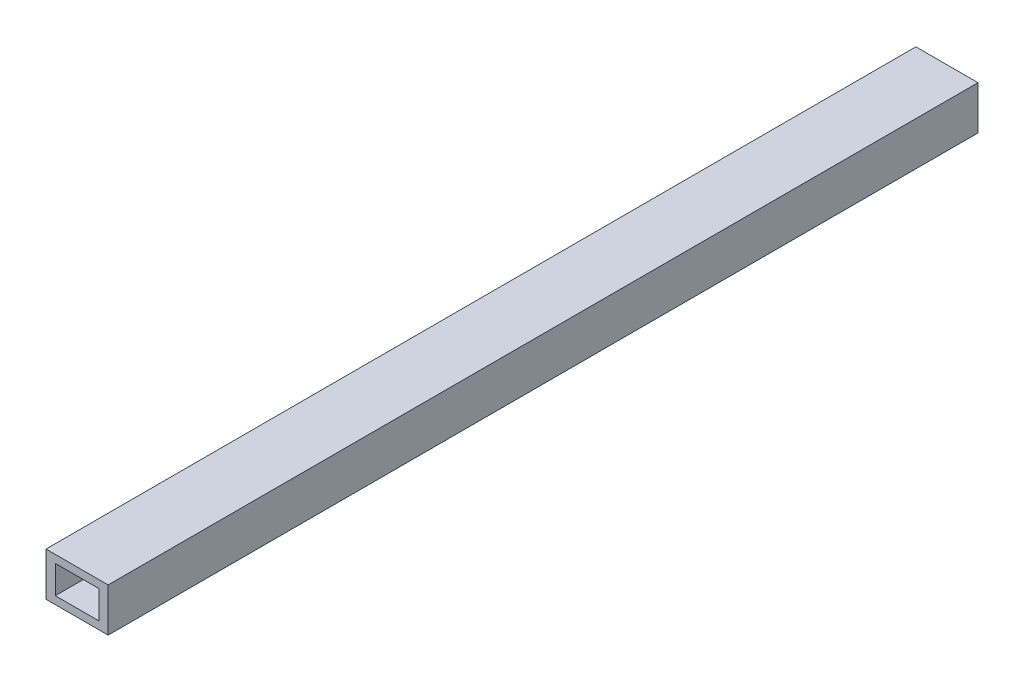
ISO-10303-21;
HEADER;
FILE_DESCRIPTION(('STEP AP214'),'2;1');
FILE_NAME('part.step','',(''),(''),'','','');
FILE_SCHEMA(('AUTOMOTIVE_DESIGN { 1 0 10303 214 1 1 1 1 }'));
ENDSEC;
DATA;
#1=APPLICATION_CONTEXT('core data for automotive mechanical design processes');
#2=APPLICATION_PROTOCOL_DEFINITION('international standard','automotive_design',2000,#1);
#3=PRODUCT_CONTEXT('',#1,'mechanical');
#4=PRODUCT('Part','Part','',(#3));
#5=PRODUCT_RELATED_PRODUCT_CATEGORY('part','',(#4));
#6=PRODUCT_DEFINITION_FORMATION('','',#4);
#7=PRODUCT_DEFINITION_CONTEXT('part definition',#1,'design');
#8=PRODUCT_DEFINITION('design','',#6,#7);
#9=PRODUCT_DEFINITION_SHAPE('','',#8);
#10=(LENGTH_UNIT() NAMED_UNIT(*) SI_UNIT(.MILLI.,.METRE.));
#11=(NAMED_UNIT(*) PLANE_ANGLE_UNIT() SI_UNIT($,.RADIAN.));
#12=(NAMED_UNIT(*) SI_UNIT($,.STERADIAN.) SOLID_ANGLE_UNIT());
#13=UNCERTAINTY_MEASURE_WITH_UNIT(LENGTH_MEASURE(1.E-05),#10,'distance_accuracy_value','');
#14=(GEOMETRIC_REPRESENTATION_CONTEXT(3) GLOBAL_UNCERTAINTY_ASSIGNED_CONTEXT((#13)) GLOBAL_UNIT_ASSIGNED_CONTEXT((#10,
#11,#12)) REPRESENTATION_CONTEXT('',''));
#15=CARTESIAN_POINT('',(0.,0.,0.));
#16=DIRECTION('',(0.,0.,1.));
#17=DIRECTION('',(1.,0.,0.));
#18=AXIS2_PLACEMENT_3D('',#15,#16,#17);
#19=CARTESIAN_POINT('',(-5.,-3.50241545893719,-140.));
#20=DIRECTION('',(-1.,0.,0.));
#21=DIRECTION('',(0.,0.,1.));
#22=AXIS2_PLACEMENT_3D('',#19,#20,#21);
#23=PLANE('',#22);
#24=DIRECTION('',(0.,-1.,0.));
#25=VECTOR('',#24,1.);
#26=CARTESIAN_POINT('',(-5.,-3.50241545893719,0.));
#27=LINE('',#26,#25);
#28=CARTESIAN_POINT('',(-5.,3.50241545893719,0.));
#29=VERTEX_POINT('',#28);
#30=CARTESIAN_POINT('',(-5.,-3.50241545893719,0.));
#31=VERTEX_POINT('',#30);
#32=EDGE_CURVE('E148',#29,#31,#27,.T.);
#33=ORIENTED_EDGE('',*,*,#32,.F.);
#34=DIRECTION('',(0.,0.,1.));
#35=VECTOR('',#34,1.);
#36=CARTESIAN_POINT('',(-5.,3.50241545893719,-140.));
#37=LINE('',#36,#35);
#38=CARTESIAN_POINT('',(-5.,3.50241545893719,-140.));
#39=VERTEX_POINT('',#38);
#40=EDGE_CURVE('E11',#39,#29,#37,.T.);
#41=ORIENTED_EDGE('',*,*,#40,.F.);
#42=DIRECTION('',(0.,-1.,0.));
#43=VECTOR('',#42,1.);
#44=CARTESIAN_POINT('',(-5.,-3.50241545893719,-140.));
#45=LINE('',#44,#43);
#46=CARTESIAN_POINT('',(-5.,-3.50241545893719,-140.));
#47=VERTEX_POINT('',#46);
#48=EDGE_CURVE('E154',#39,#47,#45,.T.);
#49=ORIENTED_EDGE('',*,*,#48,.T.);
#50=DIRECTION('',(0.,0.,1.));
#51=VECTOR('',#50,1.);
#52=CARTESIAN_POINT('',(-5.,-3.50241545893719,-140.));
#53=LINE('',#52,#51);
#54=EDGE_CURVE('E42',#47,#31,#53,.T.);
#55=ORIENTED_EDGE('',*,*,#54,.T.);
#56=EDGE_LOOP('',(#33,#41,#49,#55));
#57=FACE_BOUND('',#56,.T.);
#58=ADVANCED_FACE('F39',(#57),#23,.T.);
#59=CARTESIAN_POINT('',(5.,3.50241545893719,-140.));
#60=DIRECTION('',(0.,1.,0.));
#61=DIRECTION('',(0.,0.,1.));
#62=AXIS2_PLACEMENT_3D('',#59,#60,#61);
#63=PLANE('',#62);
#64=DIRECTION('',(-1.,0.,0.));
#65=VECTOR('',#64,1.);
#66=CARTESIAN_POINT('',(5.,3.50241545893719,0.));
#67=LINE('',#66,#65);
#68=CARTESIAN_POINT('',(5.,3.50241545893719,0.));
#69=VERTEX_POINT('',#68);
#70=EDGE_CURVE('E159',#69,#29,#67,.T.);
#71=ORIENTED_EDGE('',*,*,#70,.F.);
#72=DIRECTION('',(0.,0.,1.));
#73=VECTOR('',#72,1.);
#74=CARTESIAN_POINT('',(5.,3.50241545893719,-140.));
#75=LINE('',#74,#73);
#76=CARTESIAN_POINT('',(5.,3.50241545893719,-140.));
#77=VERTEX_POINT('',#76);
#78=EDGE_CURVE('E48',#77,#69,#75,.T.);
#79=ORIENTED_EDGE('',*,*,#78,.F.);
#80=DIRECTION('',(-1.,0.,0.));
#81=VECTOR('',#80,1.);
#82=CARTESIAN_POINT('',(5.,3.50241545893719,-140.));
#83=LINE('',#82,#81);
#84=EDGE_CURVE('E167',#77,#39,#83,.T.);
#85=ORIENTED_EDGE('',*,*,#84,.T.);
#86=ORIENTED_EDGE('',*,*,#40,.T.);
#87=EDGE_LOOP('',(#71,#79,#85,#86));
#88=FACE_BOUND('',#87,.T.);
#89=ADVANCED_FACE('F201',(#88),#63,.T.);
#90=CARTESIAN_POINT('',(5.,-3.50241545893719,-140.));
#91=DIRECTION('',(1.,0.,0.));
#92=DIRECTION('',(0.,0.,-1.));
#93=AXIS2_PLACEMENT_3D('',#90,#91,#92);
#94=PLANE('',#93);
#95=DIRECTION('',(0.,1.,0.));
#96=VECTOR('',#95,1.);
#97=CARTESIAN_POINT('',(5.,-3.50241545893719,0.));
#98=LINE('',#97,#96);
#99=CARTESIAN_POINT('',(5.,-3.50241545893719,0.));
#100=VERTEX_POINT('',#99);
#101=EDGE_CURVE('E178',#100,#69,#98,.T.);
#102=ORIENTED_EDGE('',*,*,#101,.F.);
#103=DIRECTION('',(0.,0.,1.));
#104=VECTOR('',#103,1.);
#105=CARTESIAN_POINT('',(5.,-3.50241545893719,-140.));
#106=LINE('',#105,#104);
#107=CARTESIAN_POINT('',(5.,-3.50241545893719,-140.));
#108=VERTEX_POINT('',#107);
#109=EDGE_CURVE('E186',#108,#100,#106,.T.);
#110=ORIENTED_EDGE('',*,*,#109,.F.);
#111=DIRECTION('',(0.,1.,0.));
#112=VECTOR('',#111,1.);
#113=CARTESIAN_POINT('',(5.,-3.50241545893719,-140.));
#114=LINE('',#113,#112);
#115=EDGE_CURVE('E163',#108,#77,#114,.T.);
#116=ORIENTED_EDGE('',*,*,#115,.T.);
#117=ORIENTED_EDGE('',*,*,#78,.T.);
#118=EDGE_LOOP('',(#102,#110,#116,#117));
#119=FACE_BOUND('',#118,.T.);
#120=ADVANCED_FACE('F205',(#119),#94,.T.);
#121=CARTESIAN_POINT('',(5.,-3.50241545893719,-140.));
#122=DIRECTION('',(0.,-1.,0.));
#123=DIRECTION('',(0.,0.,-1.));
#124=AXIS2_PLACEMENT_3D('',#121,#122,#123);
#125=PLANE('',#124);
#126=DIRECTION('',(1.,0.,0.));
#127=VECTOR('',#126,1.);
#128=CARTESIAN_POINT('',(5.,-3.50241545893719,0.));
#129=LINE('',#128,#127);
#130=EDGE_CURVE('E174',#31,#100,#129,.T.);
#131=ORIENTED_EDGE('',*,*,#130,.F.);
#132=ORIENTED_EDGE('',*,*,#54,.F.);
#133=DIRECTION('',(1.,0.,0.));
#134=VECTOR('',#133,1.);
#135=CARTESIAN_POINT('',(5.,-3.50241545893719,-140.));
#136=LINE('',#135,#134);
#137=EDGE_CURVE('E158',#47,#108,#136,.T.);
#138=ORIENTED_EDGE('',*,*,#137,.T.);
#139=ORIENTED_EDGE('',*,*,#109,.T.);
#140=EDGE_LOOP('',(#131,#132,#138,#139));
#141=FACE_BOUND('',#140,.T.);
#142=ADVANCED_FACE('F196',(#141),#125,.T.);
#143=CARTESIAN_POINT('',(0.,0.,-140.));
#144=DIRECTION('',(0.,0.,1.));
#145=DIRECTION('',(1.,0.,0.));
#146=AXIS2_PLACEMENT_3D('',#143,#144,#145);
#147=PLANE('',#146);
#148=DIRECTION('',(-1.,0.,0.));
#149=VECTOR('',#148,1.);
#150=CARTESIAN_POINT('',(3.5,2.2524154589372,-140.));
#151=LINE('',#150,#149);
#152=CARTESIAN_POINT('',(3.5,2.2524154589372,-140.));
#153=VERTEX_POINT('',#152);
#154=CARTESIAN_POINT('',(-3.5,2.25241545893719,-140.));
#155=VERTEX_POINT('',#154);
#156=EDGE_CURVE('E114',#153,#155,#151,.T.);
#157=ORIENTED_EDGE('',*,*,#156,.T.);
#158=DIRECTION('',(0.,-1.,0.));
#159=VECTOR('',#158,1.);
#160=CARTESIAN_POINT('',(-3.5,-2.2524154589372,-140.));
#161=LINE('',#160,#159);
#162=CARTESIAN_POINT('',(-3.5,-2.2524154589372,-140.));
#163=VERTEX_POINT('',#162);
#164=EDGE_CURVE('E107',#155,#163,#161,.T.);
#165=ORIENTED_EDGE('',*,*,#164,.T.);
#166=DIRECTION('',(1.,0.,0.));
#167=VECTOR('',#166,1.);
#168=CARTESIAN_POINT('',(3.5,-2.2524154589372,-140.));
#169=LINE('',#168,#167);
#170=CARTESIAN_POINT('',(3.5,-2.2524154589372,-140.));
#171=VERTEX_POINT('',#170);
#172=EDGE_CURVE('E117',#163,#171,#169,.T.);
#173=ORIENTED_EDGE('',*,*,#172,.T.);
#174=DIRECTION('',(0.,1.,0.));
#175=VECTOR('',#174,1.);
#176=CARTESIAN_POINT('',(3.5,-2.2524154589372,-140.));
#177=LINE('',#176,#175);
#178=EDGE_CURVE('E56',#171,#153,#177,.T.);
#179=ORIENTED_EDGE('',*,*,#178,.T.);
#180=EDGE_LOOP('',(#157,#165,#173,#179));
#181=FACE_BOUND('',#180,.T.);
#182=ORIENTED_EDGE('',*,*,#48,.F.);
#183=ORIENTED_EDGE('',*,*,#84,.F.);
#184=ORIENTED_EDGE('',*,*,#115,.F.);
#185=ORIENTED_EDGE('',*,*,#137,.F.);
#186=EDGE_LOOP('',(#182,#183,#184,#185));
#187=FACE_BOUND('',#186,.T.);
#188=ADVANCED_FACE('F122',(#181,#187),#147,.F.);
#189=CARTESIAN_POINT('',(0.,0.,0.));
#190=DIRECTION('',(0.,0.,1.));
#191=DIRECTION('',(1.,0.,0.));
#192=AXIS2_PLACEMENT_3D('',#189,#190,#191);
#193=PLANE('',#192);
#194=DIRECTION('',(0.,-1.,0.));
#195=VECTOR('',#194,1.);
#196=CARTESIAN_POINT('',(-3.5,-2.2524154589372,0.));
#197=LINE('',#196,#195);
#198=CARTESIAN_POINT('',(-3.5,2.25241545893719,0.));
#199=VERTEX_POINT('',#198);
#200=CARTESIAN_POINT('',(-3.5,-2.2524154589372,0.));
#201=VERTEX_POINT('',#200);
#202=EDGE_CURVE('E64',#199,#201,#197,.T.);
#203=ORIENTED_EDGE('',*,*,#202,.F.);
#204=DIRECTION('',(-1.,0.,0.));
#205=VECTOR('',#204,1.);
#206=CARTESIAN_POINT('',(3.5,2.2524154589372,0.));
#207=LINE('',#206,#205);
#208=CARTESIAN_POINT('',(3.5,2.2524154589372,0.));
#209=VERTEX_POINT('',#208);
#210=EDGE_CURVE('E126',#209,#199,#207,.T.);
#211=ORIENTED_EDGE('',*,*,#210,.F.);
#212=DIRECTION('',(0.,1.,0.));
#213=VECTOR('',#212,1.);
#214=CARTESIAN_POINT('',(3.5,-2.2524154589372,0.));
#215=LINE('',#214,#213);
#216=CARTESIAN_POINT('',(3.5,-2.2524154589372,0.));
#217=VERTEX_POINT('',#216);
#218=EDGE_CURVE('E130',#217,#209,#215,.T.);
#219=ORIENTED_EDGE('',*,*,#218,.F.);
#220=DIRECTION('',(1.,0.,0.));
#221=VECTOR('',#220,1.);
#222=CARTESIAN_POINT('',(3.5,-2.2524154589372,0.));
#223=LINE('',#222,#221);
#224=EDGE_CURVE('E139',#201,#217,#223,.T.);
#225=ORIENTED_EDGE('',*,*,#224,.F.);
#226=EDGE_LOOP('',(#203,#211,#219,#225));
#227=FACE_BOUND('',#226,.T.);
#228=ORIENTED_EDGE('',*,*,#32,.T.);
#229=ORIENTED_EDGE('',*,*,#130,.T.);
#230=ORIENTED_EDGE('',*,*,#101,.T.);
#231=ORIENTED_EDGE('',*,*,#70,.T.);
#232=EDGE_LOOP('',(#228,#229,#230,#231));
#233=FACE_BOUND('',#232,.T.);
#234=ADVANCED_FACE('F198',(#227,#233),#193,.T.);
#235=CARTESIAN_POINT('',(-3.5,-2.2524154589372,-140.));
#236=DIRECTION('',(-1.,0.,0.));
#237=DIRECTION('',(0.,0.,1.));
#238=AXIS2_PLACEMENT_3D('',#235,#236,#237);
#239=PLANE('',#238);
#240=ORIENTED_EDGE('',*,*,#202,.T.);
#241=DIRECTION('',(0.,0.,1.));
#242=VECTOR('',#241,1.);
#243=CARTESIAN_POINT('',(-3.5,-2.2524154589372,-140.));
#244=LINE('',#243,#242);
#245=EDGE_CURVE('E103',#163,#201,#244,.T.);
#246=ORIENTED_EDGE('',*,*,#245,.F.);
#247=ORIENTED_EDGE('',*,*,#164,.F.);
#248=DIRECTION('',(0.,0.,1.));
#249=VECTOR('',#248,1.);
#250=CARTESIAN_POINT('',(-3.5,2.25241545893719,-140.));
#251=LINE('',#250,#249);
#252=EDGE_CURVE('E145',#155,#199,#251,.T.);
#253=ORIENTED_EDGE('',*,*,#252,.T.);
#254=EDGE_LOOP('',(#240,#246,#247,#253));
#255=FACE_BOUND('',#254,.T.);
#256=ADVANCED_FACE('F105',(#255),#239,.F.);
#257=CARTESIAN_POINT('',(3.5,2.2524154589372,-140.));
#258=DIRECTION('',(0.,1.,0.));
#259=DIRECTION('',(-1.,0.,0.));
#260=AXIS2_PLACEMENT_3D('',#257,#258,#259);
#261=PLANE('',#260);
#262=ORIENTED_EDGE('',*,*,#210,.T.);
#263=ORIENTED_EDGE('',*,*,#252,.F.);
#264=ORIENTED_EDGE('',*,*,#156,.F.);
#265=DIRECTION('',(0.,0.,1.));
#266=VECTOR('',#265,1.);
#267=CARTESIAN_POINT('',(3.5,2.2524154589372,-140.));
#268=LINE('',#267,#266);
#269=EDGE_CURVE('E149',#153,#209,#268,.T.);
#270=ORIENTED_EDGE('',*,*,#269,.T.);
#271=EDGE_LOOP('',(#262,#263,#264,#270));
#272=FACE_BOUND('',#271,.T.);
#273=ADVANCED_FACE('F256',(#272),#261,.F.);
#274=CARTESIAN_POINT('',(3.5,-2.2524154589372,-140.));
#275=DIRECTION('',(1.,0.,0.));
#276=DIRECTION('',(0.,0.,-1.));
#277=AXIS2_PLACEMENT_3D('',#274,#275,#276);
#278=PLANE('',#277);
#279=ORIENTED_EDGE('',*,*,#218,.T.);
#280=ORIENTED_EDGE('',*,*,#269,.F.);
#281=ORIENTED_EDGE('',*,*,#178,.F.);
#282=DIRECTION('',(0.,0.,1.));
#283=VECTOR('',#282,1.);
#284=CARTESIAN_POINT('',(3.5,-2.2524154589372,-140.));
#285=LINE('',#284,#283);
#286=EDGE_CURVE('E113',#171,#217,#285,.T.);
#287=ORIENTED_EDGE('',*,*,#286,.T.);
#288=EDGE_LOOP('',(#279,#280,#281,#287));
#289=FACE_BOUND('',#288,.T.);
#290=ADVANCED_FACE('F265',(#289),#278,.F.);
#291=CARTESIAN_POINT('',(3.5,-2.2524154589372,-140.));
#292=DIRECTION('',(0.,-1.,0.));
#293=DIRECTION('',(1.,0.,0.));
#294=AXIS2_PLACEMENT_3D('',#291,#292,#293);
#295=PLANE('',#294);
#296=ORIENTED_EDGE('',*,*,#224,.T.);
#297=ORIENTED_EDGE('',*,*,#286,.F.);
#298=ORIENTED_EDGE('',*,*,#172,.F.);
#299=ORIENTED_EDGE('',*,*,#245,.T.);
#300=EDGE_LOOP('',(#296,#297,#298,#299));
#301=FACE_BOUND('',#300,.T.);
#302=ADVANCED_FACE('F118',(#301),#295,.F.);
#303=CLOSED_SHELL('',(#58,#89,#120,#142,#188,#234,#256,#273,#290,#302));
#304=MANIFOLD_SOLID_BREP('B2',#303);
#305=ADVANCED_BREP_SHAPE_REPRESENTATION('',(#18,#304),#14);
#306=SHAPE_DEFINITION_REPRESENTATION(#9,#305);
ENDSEC;
END-ISO-10303-21;
